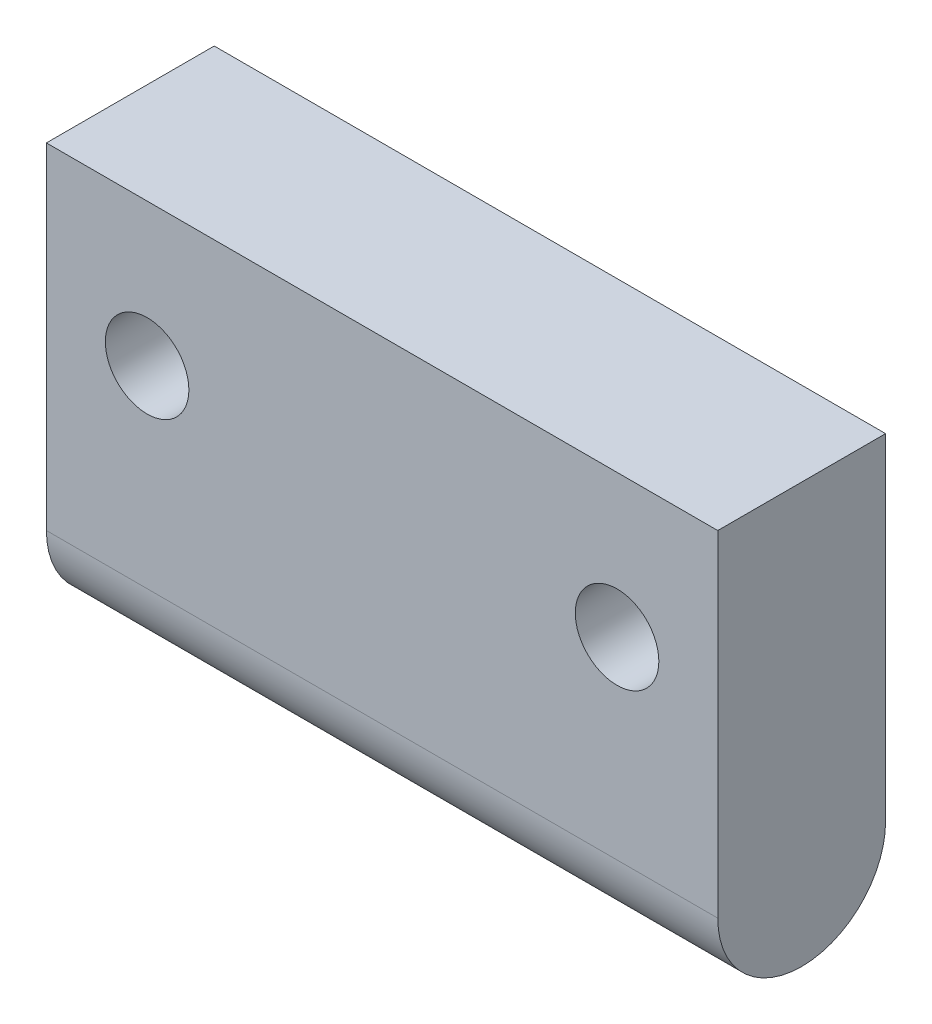
ISO-10303-21;
HEADER;
FILE_DESCRIPTION(('STEP AP214'),'2;1');
FILE_NAME('part.step','',(''),(''),'','','');
FILE_SCHEMA(('AUTOMOTIVE_DESIGN { 1 0 10303 214 1 1 1 1 }'));
ENDSEC;
DATA;
#1=APPLICATION_CONTEXT('core data for automotive mechanical design processes');
#2=APPLICATION_PROTOCOL_DEFINITION('international standard','automotive_design',2000,#1);
#3=PRODUCT_CONTEXT('',#1,'mechanical');
#4=PRODUCT('Part','Part','',(#3));
#5=PRODUCT_RELATED_PRODUCT_CATEGORY('part','',(#4));
#6=PRODUCT_DEFINITION_FORMATION('','',#4);
#7=PRODUCT_DEFINITION_CONTEXT('part definition',#1,'design');
#8=PRODUCT_DEFINITION('design','',#6,#7);
#9=PRODUCT_DEFINITION_SHAPE('','',#8);
#10=(LENGTH_UNIT() NAMED_UNIT(*) SI_UNIT(.MILLI.,.METRE.));
#11=(NAMED_UNIT(*) PLANE_ANGLE_UNIT() SI_UNIT($,.RADIAN.));
#12=(NAMED_UNIT(*) SI_UNIT($,.STERADIAN.) SOLID_ANGLE_UNIT());
#13=UNCERTAINTY_MEASURE_WITH_UNIT(LENGTH_MEASURE(1.E-05),#10,'distance_accuracy_value','');
#14=(GEOMETRIC_REPRESENTATION_CONTEXT(3) GLOBAL_UNCERTAINTY_ASSIGNED_CONTEXT((#13)) GLOBAL_UNIT_ASSIGNED_CONTEXT((#10,
#11,#12)) REPRESENTATION_CONTEXT('',''));
#15=CARTESIAN_POINT('',(0.,0.,0.));
#16=DIRECTION('',(0.,0.,1.));
#17=DIRECTION('',(1.,0.,0.));
#18=AXIS2_PLACEMENT_3D('',#15,#16,#17);
#19=CARTESIAN_POINT('',(20.,20.,0.));
#20=DIRECTION('',(0.,-1.,0.));
#21=DIRECTION('',(0.,0.,-1.));
#22=AXIS2_PLACEMENT_3D('',#19,#20,#21);
#23=PLANE('',#22);
#24=DIRECTION('',(0.,0.,1.));
#25=VECTOR('',#24,1.);
#26=CARTESIAN_POINT('',(-20.,20.,0.));
#27=LINE('',#26,#25);
#28=CARTESIAN_POINT('',(-20.,20.,-10.));
#29=VERTEX_POINT('',#28);
#30=CARTESIAN_POINT('',(-20.,20.,0.));
#31=VERTEX_POINT('',#30);
#32=EDGE_CURVE('E95',#29,#31,#27,.T.);
#33=ORIENTED_EDGE('',*,*,#32,.T.);
#34=DIRECTION('',(-1.,0.,0.));
#35=VECTOR('',#34,1.);
#36=CARTESIAN_POINT('',(20.,20.,0.));
#37=LINE('',#36,#35);
#38=CARTESIAN_POINT('',(20.,20.,0.));
#39=VERTEX_POINT('',#38);
#40=EDGE_CURVE('E11',#39,#31,#37,.T.);
#41=ORIENTED_EDGE('',*,*,#40,.F.);
#42=DIRECTION('',(0.,0.,1.));
#43=VECTOR('',#42,1.);
#44=CARTESIAN_POINT('',(20.,20.,0.));
#45=LINE('',#44,#43);
#46=CARTESIAN_POINT('',(20.,20.,-10.));
#47=VERTEX_POINT('',#46);
#48=EDGE_CURVE('E83',#47,#39,#45,.T.);
#49=ORIENTED_EDGE('',*,*,#48,.F.);
#50=DIRECTION('',(-1.,0.,0.));
#51=VECTOR('',#50,1.);
#52=CARTESIAN_POINT('',(20.,20.,-10.));
#53=LINE('',#52,#51);
#54=EDGE_CURVE('E91',#47,#29,#53,.T.);
#55=ORIENTED_EDGE('',*,*,#54,.T.);
#56=EDGE_LOOP('',(#33,#41,#49,#55));
#57=FACE_BOUND('',#56,.T.);
#58=ADVANCED_FACE('F32',(#57),#23,.F.);
#59=CARTESIAN_POINT('',(20.,20.,0.));
#60=DIRECTION('',(0.,0.,-1.));
#61=DIRECTION('',(0.,1.,0.));
#62=AXIS2_PLACEMENT_3D('',#59,#60,#61);
#63=PLANE('',#62);
#64=CARTESIAN_POINT('',(-14.,11.5,0.));
#65=DIRECTION('',(0.,0.,1.));
#66=DIRECTION('',(1.,0.,0.));
#67=AXIS2_PLACEMENT_3D('',#64,#65,#66);
#68=CIRCLE('',#67,2.4892);
#69=CARTESIAN_POINT('',(-11.5108,11.5,0.));
#70=VERTEX_POINT('',#69);
#71=EDGE_CURVE('E117',#70,#70,#68,.T.);
#72=ORIENTED_EDGE('',*,*,#71,.F.);
#73=EDGE_LOOP('',(#72));
#74=FACE_BOUND('',#73,.T.);
#75=CARTESIAN_POINT('',(14.,11.5,0.));
#76=DIRECTION('',(0.,0.,1.));
#77=DIRECTION('',(1.,0.,0.));
#78=AXIS2_PLACEMENT_3D('',#75,#76,#77);
#79=CIRCLE('',#78,2.4892);
#80=CARTESIAN_POINT('',(16.4892,11.5,0.));
#81=VERTEX_POINT('',#80);
#82=EDGE_CURVE('E111',#81,#81,#79,.T.);
#83=ORIENTED_EDGE('',*,*,#82,.F.);
#84=EDGE_LOOP('',(#83));
#85=FACE_BOUND('',#84,.T.);
#86=DIRECTION('',(0.,-1.,0.));
#87=VECTOR('',#86,1.);
#88=CARTESIAN_POINT('',(-20.,20.,0.));
#89=LINE('',#88,#87);
#90=CARTESIAN_POINT('',(-20.,0.,0.));
#91=VERTEX_POINT('',#90);
#92=EDGE_CURVE('E87',#31,#91,#89,.T.);
#93=ORIENTED_EDGE('',*,*,#92,.T.);
#94=DIRECTION('',(-1.,0.,0.));
#95=VECTOR('',#94,1.);
#96=CARTESIAN_POINT('',(20.,0.,0.));
#97=LINE('',#96,#95);
#98=CARTESIAN_POINT('',(20.,0.,0.));
#99=VERTEX_POINT('',#98);
#100=EDGE_CURVE('E40',#99,#91,#97,.T.);
#101=ORIENTED_EDGE('',*,*,#100,.F.);
#102=DIRECTION('',(0.,-1.,0.));
#103=VECTOR('',#102,1.);
#104=CARTESIAN_POINT('',(20.,20.,0.));
#105=LINE('',#104,#103);
#106=EDGE_CURVE('E78',#39,#99,#105,.T.);
#107=ORIENTED_EDGE('',*,*,#106,.F.);
#108=ORIENTED_EDGE('',*,*,#40,.T.);
#109=EDGE_LOOP('',(#93,#101,#107,#108));
#110=FACE_BOUND('',#109,.T.);
#111=ADVANCED_FACE('F86',(#74,#85,#110),#63,.F.);
#112=CARTESIAN_POINT('',(20.,0.,-5.));
#113=DIRECTION('',(-1.,0.,0.));
#114=DIRECTION('',(0.,0.,1.));
#115=AXIS2_PLACEMENT_3D('',#112,#113,#114);
#116=CYLINDRICAL_SURFACE('',#115,5.);
#117=CARTESIAN_POINT('',(-20.,0.,-5.));
#118=DIRECTION('',(1.,0.,0.));
#119=DIRECTION('',(0.,0.,-1.));
#120=AXIS2_PLACEMENT_3D('',#117,#118,#119);
#121=CIRCLE('',#120,5.);
#122=CARTESIAN_POINT('',(-20.,0.,-10.));
#123=VERTEX_POINT('',#122);
#124=EDGE_CURVE('E65',#91,#123,#121,.T.);
#125=ORIENTED_EDGE('',*,*,#124,.T.);
#126=DIRECTION('',(-1.,0.,0.));
#127=VECTOR('',#126,1.);
#128=CARTESIAN_POINT('',(20.,0.,-10.));
#129=LINE('',#128,#127);
#130=CARTESIAN_POINT('',(20.,0.,-10.));
#131=VERTEX_POINT('',#130);
#132=EDGE_CURVE('E88',#131,#123,#129,.T.);
#133=ORIENTED_EDGE('',*,*,#132,.F.);
#134=CARTESIAN_POINT('',(20.,0.,-5.));
#135=DIRECTION('',(1.,0.,0.));
#136=DIRECTION('',(0.,0.,-1.));
#137=AXIS2_PLACEMENT_3D('',#134,#135,#136);
#138=CIRCLE('',#137,5.);
#139=EDGE_CURVE('E81',#99,#131,#138,.T.);
#140=ORIENTED_EDGE('',*,*,#139,.F.);
#141=ORIENTED_EDGE('',*,*,#100,.T.);
#142=EDGE_LOOP('',(#125,#133,#140,#141));
#143=FACE_BOUND('',#142,.T.);
#144=ADVANCED_FACE('F89',(#143),#116,.T.);
#145=CARTESIAN_POINT('',(20.,20.,-10.));
#146=DIRECTION('',(0.,0.,1.));
#147=DIRECTION('',(0.,-1.,0.));
#148=AXIS2_PLACEMENT_3D('',#145,#146,#147);
#149=PLANE('',#148);
#150=CARTESIAN_POINT('',(-14.,11.5,-10.));
#151=DIRECTION('',(0.,0.,1.));
#152=DIRECTION('',(0.,-1.,0.));
#153=AXIS2_PLACEMENT_3D('',#150,#151,#152);
#154=CIRCLE('',#153,2.48919999999999);
#155=CARTESIAN_POINT('',(-14.,9.01080000000001,-10.));
#156=VERTEX_POINT('',#155);
#157=EDGE_CURVE('E114',#156,#156,#154,.T.);
#158=ORIENTED_EDGE('',*,*,#157,.T.);
#159=EDGE_LOOP('',(#158));
#160=FACE_BOUND('',#159,.T.);
#161=CARTESIAN_POINT('',(14.,11.5,-10.));
#162=DIRECTION('',(0.,0.,1.));
#163=DIRECTION('',(0.,-1.,0.));
#164=AXIS2_PLACEMENT_3D('',#161,#162,#163);
#165=CIRCLE('',#164,2.48919999999999);
#166=CARTESIAN_POINT('',(14.,9.01080000000001,-10.));
#167=VERTEX_POINT('',#166);
#168=EDGE_CURVE('E98',#167,#167,#165,.T.);
#169=ORIENTED_EDGE('',*,*,#168,.T.);
#170=EDGE_LOOP('',(#169));
#171=FACE_BOUND('',#170,.T.);
#172=DIRECTION('',(0.,1.,0.));
#173=VECTOR('',#172,1.);
#174=CARTESIAN_POINT('',(-20.,20.,-10.));
#175=LINE('',#174,#173);
#176=EDGE_CURVE('E71',#123,#29,#175,.T.);
#177=ORIENTED_EDGE('',*,*,#176,.T.);
#178=ORIENTED_EDGE('',*,*,#54,.F.);
#179=DIRECTION('',(0.,1.,0.));
#180=VECTOR('',#179,1.);
#181=CARTESIAN_POINT('',(20.,20.,-10.));
#182=LINE('',#181,#180);
#183=EDGE_CURVE('E48',#131,#47,#182,.T.);
#184=ORIENTED_EDGE('',*,*,#183,.F.);
#185=ORIENTED_EDGE('',*,*,#132,.T.);
#186=EDGE_LOOP('',(#177,#178,#184,#185));
#187=FACE_BOUND('',#186,.T.);
#188=ADVANCED_FACE('F103',(#160,#171,#187),#149,.F.);
#189=CARTESIAN_POINT('',(20.,0.,-5.));
#190=DIRECTION('',(1.,0.,0.));
#191=DIRECTION('',(0.,0.,-1.));
#192=AXIS2_PLACEMENT_3D('',#189,#190,#191);
#193=PLANE('',#192);
#194=ORIENTED_EDGE('',*,*,#48,.T.);
#195=ORIENTED_EDGE('',*,*,#106,.T.);
#196=ORIENTED_EDGE('',*,*,#139,.T.);
#197=ORIENTED_EDGE('',*,*,#183,.T.);
#198=EDGE_LOOP('',(#194,#195,#196,#197));
#199=FACE_BOUND('',#198,.T.);
#200=ADVANCED_FACE('F79',(#199),#193,.T.);
#201=CARTESIAN_POINT('',(-20.,0.,-5.));
#202=DIRECTION('',(1.,0.,0.));
#203=DIRECTION('',(0.,0.,-1.));
#204=AXIS2_PLACEMENT_3D('',#201,#202,#203);
#205=PLANE('',#204);
#206=ORIENTED_EDGE('',*,*,#32,.F.);
#207=ORIENTED_EDGE('',*,*,#176,.F.);
#208=ORIENTED_EDGE('',*,*,#124,.F.);
#209=ORIENTED_EDGE('',*,*,#92,.F.);
#210=EDGE_LOOP('',(#206,#207,#208,#209));
#211=FACE_BOUND('',#210,.T.);
#212=ADVANCED_FACE('F106',(#211),#205,.F.);
#213=CARTESIAN_POINT('',(14.,11.5,0.));
#214=DIRECTION('',(0.,0.,1.));
#215=DIRECTION('',(1.,0.,0.));
#216=AXIS2_PLACEMENT_3D('',#213,#214,#215);
#217=CYLINDRICAL_SURFACE('',#216,2.48919999999999);
#218=ORIENTED_EDGE('',*,*,#82,.T.);
#219=EDGE_LOOP('',(#218));
#220=FACE_BOUND('',#219,.T.);
#221=ORIENTED_EDGE('',*,*,#168,.F.);
#222=EDGE_LOOP('',(#221));
#223=FACE_BOUND('',#222,.T.);
#224=ADVANCED_FACE('F128',(#220,#223),#217,.F.);
#225=CARTESIAN_POINT('',(-14.,11.5,0.));
#226=DIRECTION('',(0.,0.,1.));
#227=DIRECTION('',(1.,0.,0.));
#228=AXIS2_PLACEMENT_3D('',#225,#226,#227);
#229=CYLINDRICAL_SURFACE('',#228,2.48919999999999);
#230=ORIENTED_EDGE('',*,*,#71,.T.);
#231=EDGE_LOOP('',(#230));
#232=FACE_BOUND('',#231,.T.);
#233=ORIENTED_EDGE('',*,*,#157,.F.);
#234=EDGE_LOOP('',(#233));
#235=FACE_BOUND('',#234,.T.);
#236=ADVANCED_FACE('F121',(#232,#235),#229,.F.);
#237=CLOSED_SHELL('',(#58,#111,#144,#188,#200,#212,#224,#236));
#238=MANIFOLD_SOLID_BREP('B2',#237);
#239=ADVANCED_BREP_SHAPE_REPRESENTATION('',(#18,#238),#14);
#240=SHAPE_DEFINITION_REPRESENTATION(#9,#239);
ENDSEC;
END-ISO-10303-21;
